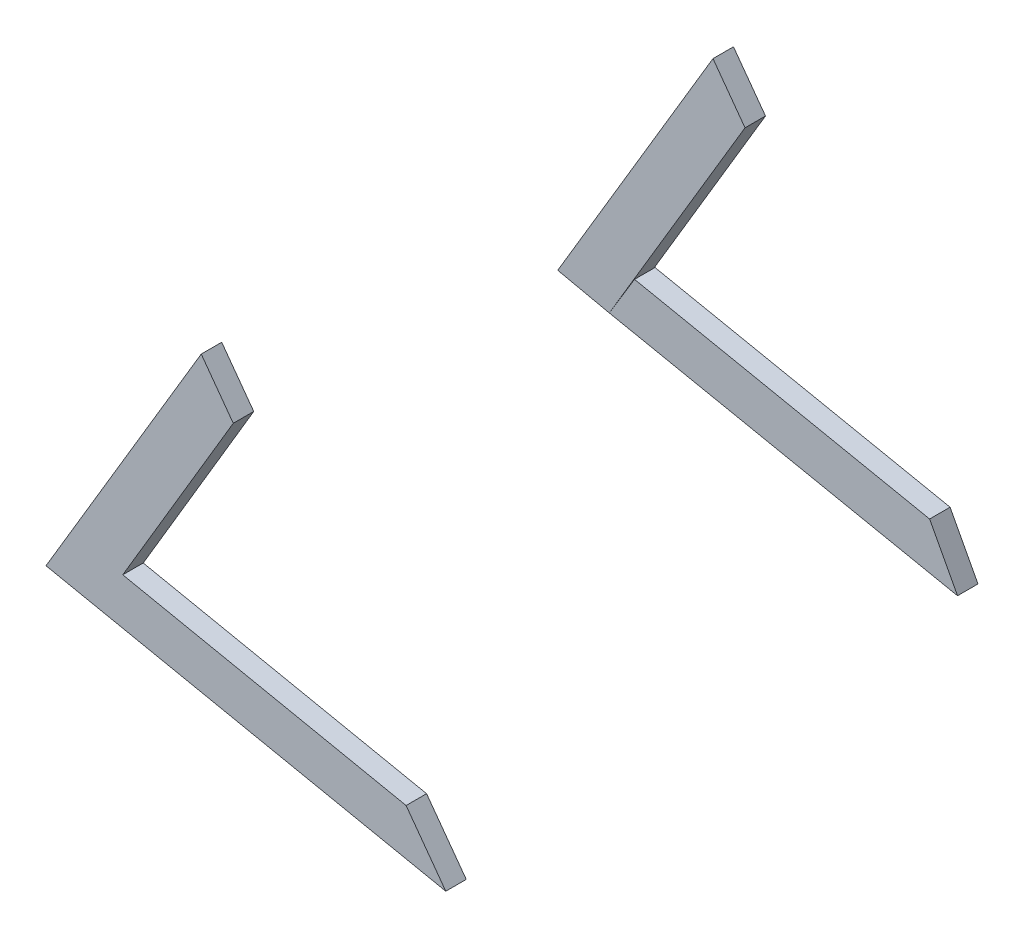
ISO-10303-21;
HEADER;
FILE_DESCRIPTION(('STEP AP214'),'2;1');
FILE_NAME('part.step','',(''),(''),'','','');
FILE_SCHEMA(('AUTOMOTIVE_DESIGN { 1 0 10303 214 1 1 1 1 }'));
ENDSEC;
DATA;
#1=APPLICATION_CONTEXT('core data for automotive mechanical design processes');
#2=APPLICATION_PROTOCOL_DEFINITION('international standard','automotive_design',2000,#1);
#3=PRODUCT_CONTEXT('',#1,'mechanical');
#4=PRODUCT('Part','Part','',(#3));
#5=PRODUCT_RELATED_PRODUCT_CATEGORY('part','',(#4));
#6=PRODUCT_DEFINITION_FORMATION('','',#4);
#7=PRODUCT_DEFINITION_CONTEXT('part definition',#1,'design');
#8=PRODUCT_DEFINITION('design','',#6,#7);
#9=PRODUCT_DEFINITION_SHAPE('','',#8);
#10=(LENGTH_UNIT() NAMED_UNIT(*) SI_UNIT(.MILLI.,.METRE.));
#11=(NAMED_UNIT(*) PLANE_ANGLE_UNIT() SI_UNIT($,.RADIAN.));
#12=(NAMED_UNIT(*) SI_UNIT($,.STERADIAN.) SOLID_ANGLE_UNIT());
#13=UNCERTAINTY_MEASURE_WITH_UNIT(LENGTH_MEASURE(1.E-05),#10,'distance_accuracy_value','');
#14=(GEOMETRIC_REPRESENTATION_CONTEXT(3) GLOBAL_UNCERTAINTY_ASSIGNED_CONTEXT((#13)) GLOBAL_UNIT_ASSIGNED_CONTEXT((#10,
#11,#12)) REPRESENTATION_CONTEXT('',''));
#15=CARTESIAN_POINT('',(0.,0.,0.));
#16=DIRECTION('',(0.,0.,1.));
#17=DIRECTION('',(1.,0.,0.));
#18=AXIS2_PLACEMENT_3D('',#15,#16,#17);
#19=CARTESIAN_POINT('',(-117.553090874824,16.4233246148434,228.608466666667));
#20=DIRECTION('',(0.860270610914541,-0.509837695739263,0.));
#21=DIRECTION('',(0.509837695739263,0.860270610914542,0.));
#22=AXIS2_PLACEMENT_3D('',#19,#20,#21);
#23=PLANE('',#22);
#24=DIRECTION('',(0.509837695739263,0.860270610914541,0.));
#25=VECTOR('',#24,1.);
#26=CARTESIAN_POINT('',(-117.553090874824,16.4233246148434,254.008466666667));
#27=LINE('',#26,#25);
#28=CARTESIAN_POINT('',(-117.553090874824,16.4233246148434,254.008466666667));
#29=VERTEX_POINT('',#28);
#30=CARTESIAN_POINT('',(19.5750936937245,247.805484267309,254.008466666667));
#31=VERTEX_POINT('',#30);
#32=EDGE_CURVE('E129',#29,#31,#27,.T.);
#33=ORIENTED_EDGE('',*,*,#32,.F.);
#34=DIRECTION('',(0.,0.,1.));
#35=VECTOR('',#34,1.);
#36=CARTESIAN_POINT('',(-117.553090874824,16.4233246148434,228.608466666667));
#37=LINE('',#36,#35);
#38=CARTESIAN_POINT('',(-117.553090874824,16.4233246148434,228.608466666667));
#39=VERTEX_POINT('',#38);
#40=EDGE_CURVE('E12',#39,#29,#37,.T.);
#41=ORIENTED_EDGE('',*,*,#40,.F.);
#42=DIRECTION('',(0.509837695739263,0.860270610914541,0.));
#43=VECTOR('',#42,1.);
#44=CARTESIAN_POINT('',(-117.553090874824,16.4233246148434,228.608466666667));
#45=LINE('',#44,#43);
#46=CARTESIAN_POINT('',(19.5750936937245,247.805484267309,228.608466666667));
#47=VERTEX_POINT('',#46);
#48=EDGE_CURVE('E143',#39,#47,#45,.T.);
#49=ORIENTED_EDGE('',*,*,#48,.T.);
#50=DIRECTION('',(0.,0.,1.));
#51=VECTOR('',#50,1.);
#52=CARTESIAN_POINT('',(19.5750936937245,247.805484267309,228.608466666667));
#53=LINE('',#52,#51);
#54=EDGE_CURVE('E47',#47,#31,#53,.T.);
#55=ORIENTED_EDGE('',*,*,#54,.T.);
#56=EDGE_LOOP('',(#33,#41,#49,#55));
#57=FACE_BOUND('',#56,.T.);
#58=ADVANCED_FACE('F44',(#57),#23,.T.);
#59=CARTESIAN_POINT('',(234.040197192423,-55.6809077185819,228.608466666667));
#60=DIRECTION('',(0.200897439783203,0.979612279776318,0.));
#61=DIRECTION('',(-0.979612279776318,0.200897439783203,0.));
#62=AXIS2_PLACEMENT_3D('',#59,#60,#61);
#63=PLANE('',#62);
#64=DIRECTION('',(-0.979612279776318,0.200897439783203,0.));
#65=VECTOR('',#64,1.);
#66=CARTESIAN_POINT('',(234.040197192423,-55.6809077185819,254.008466666667));
#67=LINE('',#66,#65);
#68=CARTESIAN_POINT('',(234.040197192423,-55.6809077185819,254.008466666667));
#69=VERTEX_POINT('',#68);
#70=EDGE_CURVE('E141',#69,#29,#67,.T.);
#71=ORIENTED_EDGE('',*,*,#70,.F.);
#72=DIRECTION('',(0.,0.,1.));
#73=VECTOR('',#72,1.);
#74=CARTESIAN_POINT('',(234.040197192423,-55.6809077185819,228.608466666667));
#75=LINE('',#74,#73);
#76=CARTESIAN_POINT('',(234.040197192423,-55.6809077185819,228.608466666667));
#77=VERTEX_POINT('',#76);
#78=EDGE_CURVE('E53',#77,#69,#75,.T.);
#79=ORIENTED_EDGE('',*,*,#78,.F.);
#80=DIRECTION('',(-0.979612279776318,0.200897439783203,0.));
#81=VECTOR('',#80,1.);
#82=CARTESIAN_POINT('',(234.040197192423,-55.6809077185819,228.608466666667));
#83=LINE('',#82,#81);
#84=EDGE_CURVE('E119',#77,#39,#83,.T.);
#85=ORIENTED_EDGE('',*,*,#84,.T.);
#86=ORIENTED_EDGE('',*,*,#40,.T.);
#87=EDGE_LOOP('',(#71,#79,#85,#86));
#88=FACE_BOUND('',#87,.T.);
#89=ADVANCED_FACE('F151',(#88),#63,.T.);
#90=CARTESIAN_POINT('',(283.257557222642,-123.191110578434,228.608466666667));
#91=DIRECTION('',(0.808057839026698,0.589103156321117,0.));
#92=DIRECTION('',(-0.589103156321117,0.808057839026698,0.));
#93=AXIS2_PLACEMENT_3D('',#90,#91,#92);
#94=PLANE('',#93);
#95=DIRECTION('',(-0.589103156321117,0.808057839026698,0.));
#96=VECTOR('',#95,1.);
#97=CARTESIAN_POINT('',(283.257557222642,-123.191110578434,254.008466666667));
#98=LINE('',#97,#96);
#99=CARTESIAN_POINT('',(283.257557222642,-123.191110578434,254.008466666667));
#100=VERTEX_POINT('',#99);
#101=EDGE_CURVE('E106',#100,#69,#98,.T.);
#102=ORIENTED_EDGE('',*,*,#101,.F.);
#103=DIRECTION('',(0.,0.,1.));
#104=VECTOR('',#103,1.);
#105=CARTESIAN_POINT('',(283.257557222642,-123.191110578434,228.608466666667));
#106=LINE('',#105,#104);
#107=CARTESIAN_POINT('',(283.257557222642,-123.191110578434,228.608466666667));
#108=VERTEX_POINT('',#107);
#109=EDGE_CURVE('E101',#108,#100,#106,.T.);
#110=ORIENTED_EDGE('',*,*,#109,.F.);
#111=DIRECTION('',(-0.589103156321117,0.808057839026698,0.));
#112=VECTOR('',#111,1.);
#113=CARTESIAN_POINT('',(283.257557222642,-123.191110578434,228.608466666667));
#114=LINE('',#113,#112);
#115=EDGE_CURVE('E104',#108,#77,#114,.T.);
#116=ORIENTED_EDGE('',*,*,#115,.T.);
#117=ORIENTED_EDGE('',*,*,#78,.T.);
#118=EDGE_LOOP('',(#102,#110,#116,#117));
#119=FACE_BOUND('',#118,.T.);
#120=ADVANCED_FACE('F103',(#119),#94,.T.);
#121=CARTESIAN_POINT('',(-212.796519633417,-21.4610729995281,228.608466666666));
#122=DIRECTION('',(-0.200897439783204,-0.979612279776317,0.));
#123=DIRECTION('',(0.979612279776317,-0.200897439783204,0.));
#124=AXIS2_PLACEMENT_3D('',#121,#122,#123);
#125=PLANE('',#124);
#126=DIRECTION('',(0.979612279776317,-0.200897439783204,0.));
#127=VECTOR('',#126,1.);
#128=CARTESIAN_POINT('',(-212.796519633417,-21.4610729995282,254.008466666666));
#129=LINE('',#128,#127);
#130=CARTESIAN_POINT('',(-212.796519633417,-21.4610729995282,254.008466666666));
#131=VERTEX_POINT('',#130);
#132=EDGE_CURVE('E138',#131,#100,#129,.T.);
#133=ORIENTED_EDGE('',*,*,#132,.F.);
#134=DIRECTION('',(0.,0.,1.));
#135=VECTOR('',#134,1.);
#136=CARTESIAN_POINT('',(-212.796519633417,-21.4610729995281,228.608466666666));
#137=LINE('',#136,#135);
#138=CARTESIAN_POINT('',(-212.796519633417,-21.4610729995281,228.608466666666));
#139=VERTEX_POINT('',#138);
#140=EDGE_CURVE('E111',#139,#131,#137,.T.);
#141=ORIENTED_EDGE('',*,*,#140,.F.);
#142=DIRECTION('',(0.979612279776317,-0.200897439783204,0.));
#143=VECTOR('',#142,1.);
#144=CARTESIAN_POINT('',(-212.796519633417,-21.4610729995281,228.608466666666));
#145=LINE('',#144,#143);
#146=EDGE_CURVE('E117',#139,#108,#145,.T.);
#147=ORIENTED_EDGE('',*,*,#146,.T.);
#148=ORIENTED_EDGE('',*,*,#109,.T.);
#149=EDGE_LOOP('',(#133,#141,#147,#148));
#150=FACE_BOUND('',#149,.T.);
#151=ADVANCED_FACE('F121',(#150),#125,.T.);
#152=CARTESIAN_POINT('',(-20.1707781777962,302.323887351923,228.608466666667));
#153=DIRECTION('',(-0.859413487907199,0.511281191521048,0.));
#154=DIRECTION('',(-0.511281191521048,-0.859413487907199,0.));
#155=AXIS2_PLACEMENT_3D('',#152,#153,#154);
#156=PLANE('',#155);
#157=DIRECTION('',(-0.511281191521048,-0.859413487907199,0.));
#158=VECTOR('',#157,1.);
#159=CARTESIAN_POINT('',(-20.1707781777962,302.323887351923,254.008466666667));
#160=LINE('',#159,#158);
#161=CARTESIAN_POINT('',(-20.1707781777962,302.323887351923,254.008466666667));
#162=VERTEX_POINT('',#161);
#163=EDGE_CURVE('E135',#162,#131,#160,.T.);
#164=ORIENTED_EDGE('',*,*,#163,.F.);
#165=DIRECTION('',(0.,0.,1.));
#166=VECTOR('',#165,1.);
#167=CARTESIAN_POINT('',(-20.1707781777962,302.323887351923,228.608466666667));
#168=LINE('',#167,#166);
#169=CARTESIAN_POINT('',(-20.1707781777962,302.323887351923,228.608466666667));
#170=VERTEX_POINT('',#169);
#171=EDGE_CURVE('E146',#170,#162,#168,.T.);
#172=ORIENTED_EDGE('',*,*,#171,.F.);
#173=DIRECTION('',(-0.511281191521048,-0.859413487907199,0.));
#174=VECTOR('',#173,1.);
#175=CARTESIAN_POINT('',(-20.1707781777962,302.323887351923,228.608466666667));
#176=LINE('',#175,#174);
#177=EDGE_CURVE('E122',#170,#139,#176,.T.);
#178=ORIENTED_EDGE('',*,*,#177,.T.);
#179=ORIENTED_EDGE('',*,*,#140,.T.);
#180=EDGE_LOOP('',(#164,#172,#178,#179));
#181=FACE_BOUND('',#180,.T.);
#182=ADVANCED_FACE('F164',(#181),#156,.T.);
#183=CARTESIAN_POINT('',(19.5750936937245,247.805484267309,228.608466666667));
#184=DIRECTION('',(0.808057839026698,0.589103156321117,0.));
#185=DIRECTION('',(-0.589103156321117,0.808057839026699,0.));
#186=AXIS2_PLACEMENT_3D('',#183,#184,#185);
#187=PLANE('',#186);
#188=DIRECTION('',(-0.589103156321117,0.808057839026698,0.));
#189=VECTOR('',#188,1.);
#190=CARTESIAN_POINT('',(19.5750936937245,247.805484267309,254.008466666667));
#191=LINE('',#190,#189);
#192=EDGE_CURVE('E132',#31,#162,#191,.T.);
#193=ORIENTED_EDGE('',*,*,#192,.F.);
#194=ORIENTED_EDGE('',*,*,#54,.F.);
#195=DIRECTION('',(-0.589103156321117,0.808057839026698,0.));
#196=VECTOR('',#195,1.);
#197=CARTESIAN_POINT('',(19.5750936937245,247.805484267309,228.608466666667));
#198=LINE('',#197,#196);
#199=EDGE_CURVE('E124',#47,#170,#198,.T.);
#200=ORIENTED_EDGE('',*,*,#199,.T.);
#201=ORIENTED_EDGE('',*,*,#171,.T.);
#202=EDGE_LOOP('',(#193,#194,#200,#201));
#203=FACE_BOUND('',#202,.T.);
#204=ADVANCED_FACE('F148',(#203),#187,.T.);
#205=CARTESIAN_POINT('',(-2.42270502828796E-13,-1.85914991608062E-13,228.608466666667));
#206=DIRECTION('',(0.,0.,-1.));
#207=DIRECTION('',(-1.,0.,0.));
#208=AXIS2_PLACEMENT_3D('',#205,#206,#207);
#209=PLANE('',#208);
#210=ORIENTED_EDGE('',*,*,#48,.F.);
#211=ORIENTED_EDGE('',*,*,#84,.F.);
#212=ORIENTED_EDGE('',*,*,#115,.F.);
#213=ORIENTED_EDGE('',*,*,#146,.F.);
#214=ORIENTED_EDGE('',*,*,#177,.F.);
#215=ORIENTED_EDGE('',*,*,#199,.F.);
#216=EDGE_LOOP('',(#210,#211,#212,#213,#214,#215));
#217=FACE_BOUND('',#216,.T.);
#218=ADVANCED_FACE('F115',(#217),#209,.T.);
#219=CARTESIAN_POINT('',(-2.69614855092981E-13,-2.05850005475127E-13,254.008466666667));
#220=DIRECTION('',(0.,0.,-1.));
#221=DIRECTION('',(-1.,0.,0.));
#222=AXIS2_PLACEMENT_3D('',#219,#220,#221);
#223=PLANE('',#222);
#224=ORIENTED_EDGE('',*,*,#32,.T.);
#225=ORIENTED_EDGE('',*,*,#192,.T.);
#226=ORIENTED_EDGE('',*,*,#163,.T.);
#227=ORIENTED_EDGE('',*,*,#132,.T.);
#228=ORIENTED_EDGE('',*,*,#101,.T.);
#229=ORIENTED_EDGE('',*,*,#70,.T.);
#230=EDGE_LOOP('',(#224,#225,#226,#227,#228,#229));
#231=FACE_BOUND('',#230,.T.);
#232=ADVANCED_FACE('F150',(#231),#223,.F.);
#233=CLOSED_SHELL('',(#58,#89,#120,#151,#182,#204,#218,#232));
#234=MANIFOLD_SOLID_BREP('B2',#233);
#235=CARTESIAN_POINT('',(19.5750936937253,247.805484267309,-380.991533333329));
#236=DIRECTION('',(0.808057839026695,0.589103156321121,0.));
#237=DIRECTION('',(-0.589103156321122,0.808057839026695,0.));
#238=AXIS2_PLACEMENT_3D('',#235,#236,#237);
#239=PLANE('',#238);
#240=DIRECTION('',(0.589103156321121,-0.808057839026695,0.));
#241=VECTOR('',#240,1.);
#242=CARTESIAN_POINT('',(19.5750936937253,247.805484267309,-406.391533333329));
#243=LINE('',#242,#241);
#244=CARTESIAN_POINT('',(-20.1707781777958,302.323887351923,-406.391533333329));
#245=VERTEX_POINT('',#244);
#246=CARTESIAN_POINT('',(19.5750936937253,247.805484267309,-406.391533333329));
#247=VERTEX_POINT('',#246);
#248=EDGE_CURVE('E293',#245,#247,#243,.T.);
#249=ORIENTED_EDGE('',*,*,#248,.F.);
#250=DIRECTION('',(0.,0.,-1.));
#251=VECTOR('',#250,1.);
#252=CARTESIAN_POINT('',(-20.1707781777958,302.323887351923,-380.991533333329));
#253=LINE('',#252,#251);
#254=CARTESIAN_POINT('',(-20.1707781777958,302.323887351923,-380.991533333329));
#255=VERTEX_POINT('',#254);
#256=EDGE_CURVE('E42',#255,#245,#253,.T.);
#257=ORIENTED_EDGE('',*,*,#256,.F.);
#258=DIRECTION('',(0.589103156321121,-0.808057839026695,0.));
#259=VECTOR('',#258,1.);
#260=CARTESIAN_POINT('',(19.5750936937253,247.805484267309,-380.991533333329));
#261=LINE('',#260,#259);
#262=CARTESIAN_POINT('',(19.5750936937253,247.805484267309,-380.991533333329));
#263=VERTEX_POINT('',#262);
#264=EDGE_CURVE('E287',#255,#263,#261,.T.);
#265=ORIENTED_EDGE('',*,*,#264,.T.);
#266=DIRECTION('',(0.,0.,-1.));
#267=VECTOR('',#266,1.);
#268=CARTESIAN_POINT('',(19.5750936937253,247.805484267309,-380.991533333329));
#269=LINE('',#268,#267);
#270=EDGE_CURVE('E232',#263,#247,#269,.T.);
#271=ORIENTED_EDGE('',*,*,#270,.T.);
#272=EDGE_LOOP('',(#249,#257,#265,#271));
#273=FACE_BOUND('',#272,.T.);
#274=ADVANCED_FACE('F229',(#273),#239,.T.);
#275=CARTESIAN_POINT('',(-20.1707781777958,302.323887351923,-380.991533333329));
#276=DIRECTION('',(-0.859413487907199,0.511281191521048,0.));
#277=DIRECTION('',(-0.511281191521048,-0.859413487907199,0.));
#278=AXIS2_PLACEMENT_3D('',#275,#276,#277);
#279=PLANE('',#278);
#280=DIRECTION('',(0.511281191521048,0.859413487907199,0.));
#281=VECTOR('',#280,1.);
#282=CARTESIAN_POINT('',(-20.1707781777958,302.323887351923,-406.391533333329));
#283=LINE('',#282,#281);
#284=CARTESIAN_POINT('',(-212.796519633416,-21.4610729995277,-406.391533333329));
#285=VERTEX_POINT('',#284);
#286=EDGE_CURVE('E289',#285,#245,#283,.T.);
#287=ORIENTED_EDGE('',*,*,#286,.F.);
#288=DIRECTION('',(0.,0.,-1.));
#289=VECTOR('',#288,1.);
#290=CARTESIAN_POINT('',(-212.796519633416,-21.4610729995277,-380.991533333329));
#291=LINE('',#290,#289);
#292=CARTESIAN_POINT('',(-212.796519633416,-21.4610729995277,-380.991533333329));
#293=VERTEX_POINT('',#292);
#294=EDGE_CURVE('E238',#293,#285,#291,.T.);
#295=ORIENTED_EDGE('',*,*,#294,.F.);
#296=DIRECTION('',(0.511281191521048,0.859413487907199,0.));
#297=VECTOR('',#296,1.);
#298=CARTESIAN_POINT('',(-20.1707781777958,302.323887351923,-380.991533333329));
#299=LINE('',#298,#297);
#300=EDGE_CURVE('E284',#293,#255,#299,.T.);
#301=ORIENTED_EDGE('',*,*,#300,.T.);
#302=ORIENTED_EDGE('',*,*,#256,.T.);
#303=EDGE_LOOP('',(#287,#295,#301,#302));
#304=FACE_BOUND('',#303,.T.);
#305=ADVANCED_FACE('F303',(#304),#279,.T.);
#306=CARTESIAN_POINT('',(-212.796519633416,-21.4610729995277,-380.991533333329));
#307=DIRECTION('',(-0.212068694836528,-0.97725476139558,0.));
#308=DIRECTION('',(0.97725476139558,-0.212068694836528,0.));
#309=AXIS2_PLACEMENT_3D('',#306,#307,#308);
#310=PLANE('',#309);
#311=DIRECTION('',(-0.97725476139558,0.212068694836528,0.));
#312=VECTOR('',#311,1.);
#313=CARTESIAN_POINT('',(-212.796519633416,-21.4610729995277,-406.391533333329));
#314=LINE('',#313,#312);
#315=CARTESIAN_POINT('',(-148.869597035476,-35.333503788098,-406.391533333329));
#316=VERTEX_POINT('',#315);
#317=EDGE_CURVE('E279',#316,#285,#314,.T.);
#318=ORIENTED_EDGE('',*,*,#317,.F.);
#319=DIRECTION('',(0.,0.,-1.));
#320=VECTOR('',#319,1.);
#321=CARTESIAN_POINT('',(-148.869597035476,-35.333503788098,-380.991533333329));
#322=LINE('',#321,#320);
#323=CARTESIAN_POINT('',(-148.869597035476,-35.333503788098,-380.991533333329));
#324=VERTEX_POINT('',#323);
#325=EDGE_CURVE('E274',#324,#316,#322,.T.);
#326=ORIENTED_EDGE('',*,*,#325,.F.);
#327=DIRECTION('',(-0.97725476139558,0.212068694836528,0.));
#328=VECTOR('',#327,1.);
#329=CARTESIAN_POINT('',(-212.796519633416,-21.4610729995277,-380.991533333329));
#330=LINE('',#329,#328);
#331=EDGE_CURVE('E277',#324,#293,#330,.T.);
#332=ORIENTED_EDGE('',*,*,#331,.T.);
#333=ORIENTED_EDGE('',*,*,#294,.T.);
#334=EDGE_LOOP('',(#318,#326,#332,#333));
#335=FACE_BOUND('',#334,.T.);
#336=ADVANCED_FACE('F276',(#335),#310,.T.);
#337=CARTESIAN_POINT('',(-148.869597035476,-35.333503788098,-380.991533333329));
#338=DIRECTION('',(0.859413487907199,-0.511281191521048,0.));
#339=DIRECTION('',(0.511281191521048,0.8594134879072,0.));
#340=AXIS2_PLACEMENT_3D('',#337,#338,#339);
#341=PLANE('',#340);
#342=DIRECTION('',(-0.511281191521048,-0.859413487907199,0.));
#343=VECTOR('',#342,1.);
#344=CARTESIAN_POINT('',(-148.869597035476,-35.333503788098,-406.391533333329));
#345=LINE('',#344,#343);
#346=EDGE_CURVE('E296',#247,#316,#345,.T.);
#347=ORIENTED_EDGE('',*,*,#346,.F.);
#348=ORIENTED_EDGE('',*,*,#270,.F.);
#349=DIRECTION('',(-0.511281191521048,-0.859413487907199,0.));
#350=VECTOR('',#349,1.);
#351=CARTESIAN_POINT('',(-148.869597035476,-35.333503788098,-380.991533333329));
#352=LINE('',#351,#350);
#353=EDGE_CURVE('E283',#263,#324,#352,.T.);
#354=ORIENTED_EDGE('',*,*,#353,.T.);
#355=ORIENTED_EDGE('',*,*,#325,.T.);
#356=EDGE_LOOP('',(#347,#348,#354,#355));
#357=FACE_BOUND('',#356,.T.);
#358=ADVANCED_FACE('F286',(#357),#341,.T.);
#359=CARTESIAN_POINT('',(4.46283924755751E-13,3.2535699301632E-13,-380.991533333329));
#360=DIRECTION('',(0.,0.,1.));
#361=DIRECTION('',(1.,0.,0.));
#362=AXIS2_PLACEMENT_3D('',#359,#360,#361);
#363=PLANE('',#362);
#364=ORIENTED_EDGE('',*,*,#264,.F.);
#365=ORIENTED_EDGE('',*,*,#300,.F.);
#366=ORIENTED_EDGE('',*,*,#331,.F.);
#367=ORIENTED_EDGE('',*,*,#353,.F.);
#368=EDGE_LOOP('',(#364,#365,#366,#367));
#369=FACE_BOUND('',#368,.T.);
#370=ADVANCED_FACE('F282',(#369),#363,.T.);
#371=CARTESIAN_POINT('',(4.73628277019936E-13,3.45292006883385E-13,-406.391533333329));
#372=DIRECTION('',(0.,0.,1.));
#373=DIRECTION('',(1.,0.,0.));
#374=AXIS2_PLACEMENT_3D('',#371,#372,#373);
#375=PLANE('',#374);
#376=ORIENTED_EDGE('',*,*,#248,.T.);
#377=ORIENTED_EDGE('',*,*,#346,.T.);
#378=ORIENTED_EDGE('',*,*,#317,.T.);
#379=ORIENTED_EDGE('',*,*,#286,.T.);
#380=EDGE_LOOP('',(#376,#377,#378,#379));
#381=FACE_BOUND('',#380,.T.);
#382=ADVANCED_FACE('F302',(#381),#375,.F.);
#383=CLOSED_SHELL('',(#274,#305,#336,#358,#370,#382));
#384=MANIFOLD_SOLID_BREP('B6',#383);
#385=CARTESIAN_POINT('',(283.257557222643,-123.191110578434,-380.991533333329));
#386=DIRECTION('',(-0.199238024868072,-0.979951126050003,0.));
#387=DIRECTION('',(0.979951126050003,-0.199238024868072,0.));
#388=AXIS2_PLACEMENT_3D('',#385,#386,#387);
#389=PLANE('',#388);
#390=DIRECTION('',(-0.979951126050003,0.199238024868072,0.));
#391=VECTOR('',#390,1.);
#392=CARTESIAN_POINT('',(283.257557222643,-123.191110578434,-406.391533333329));
#393=LINE('',#392,#391);
#394=CARTESIAN_POINT('',(283.257557222643,-123.191110578434,-406.391533333329));
#395=VERTEX_POINT('',#394);
#396=CARTESIAN_POINT('',(-148.869597035476,-35.3335037880979,-406.391533333329));
#397=VERTEX_POINT('',#396);
#398=EDGE_CURVE('E417',#395,#397,#393,.T.);
#399=ORIENTED_EDGE('',*,*,#398,.F.);
#400=DIRECTION('',(0.,0.,-1.));
#401=VECTOR('',#400,1.);
#402=CARTESIAN_POINT('',(283.257557222643,-123.191110578434,-380.991533333329));
#403=LINE('',#402,#401);
#404=CARTESIAN_POINT('',(283.257557222643,-123.191110578434,-380.991533333329));
#405=VERTEX_POINT('',#404);
#406=EDGE_CURVE('E227',#405,#395,#403,.T.);
#407=ORIENTED_EDGE('',*,*,#406,.F.);
#408=DIRECTION('',(-0.979951126050003,0.199238024868072,0.));
#409=VECTOR('',#408,1.);
#410=CARTESIAN_POINT('',(283.257557222643,-123.191110578434,-380.991533333329));
#411=LINE('',#410,#409);
#412=CARTESIAN_POINT('',(-148.869597035476,-35.3335037880979,-380.991533333329));
#413=VERTEX_POINT('',#412);
#414=EDGE_CURVE('E411',#405,#413,#411,.T.);
#415=ORIENTED_EDGE('',*,*,#414,.T.);
#416=DIRECTION('',(0.,0.,-1.));
#417=VECTOR('',#416,1.);
#418=CARTESIAN_POINT('',(-148.869597035476,-35.3335037880979,-380.991533333329));
#419=LINE('',#418,#417);
#420=EDGE_CURVE('E356',#413,#397,#419,.T.);
#421=ORIENTED_EDGE('',*,*,#420,.T.);
#422=EDGE_LOOP('',(#399,#407,#415,#421));
#423=FACE_BOUND('',#422,.T.);
#424=ADVANCED_FACE('F353',(#423),#389,.T.);
#425=CARTESIAN_POINT('',(248.617806819178,-58.024435565595,-380.991533333329));
#426=DIRECTION('',(0.883003671158202,0.469366079644809,0.));
#427=DIRECTION('',(-0.469366079644809,0.883003671158202,0.));
#428=AXIS2_PLACEMENT_3D('',#425,#426,#427);
#429=PLANE('',#428);
#430=DIRECTION('',(0.469366079644809,-0.883003671158202,0.));
#431=VECTOR('',#430,1.);
#432=CARTESIAN_POINT('',(248.617806819178,-58.024435565595,-406.391533333329));
#433=LINE('',#432,#431);
#434=CARTESIAN_POINT('',(248.617806819178,-58.024435565595,-406.391533333329));
#435=VERTEX_POINT('',#434);
#436=EDGE_CURVE('E413',#435,#395,#433,.T.);
#437=ORIENTED_EDGE('',*,*,#436,.F.);
#438=DIRECTION('',(0.,0.,-1.));
#439=VECTOR('',#438,1.);
#440=CARTESIAN_POINT('',(248.617806819178,-58.024435565595,-380.991533333329));
#441=LINE('',#440,#439);
#442=CARTESIAN_POINT('',(248.617806819178,-58.024435565595,-380.991533333329));
#443=VERTEX_POINT('',#442);
#444=EDGE_CURVE('E362',#443,#435,#441,.T.);
#445=ORIENTED_EDGE('',*,*,#444,.F.);
#446=DIRECTION('',(0.469366079644809,-0.883003671158202,0.));
#447=VECTOR('',#446,1.);
#448=CARTESIAN_POINT('',(248.617806819178,-58.024435565595,-380.991533333329));
#449=LINE('',#448,#447);
#450=EDGE_CURVE('E408',#443,#405,#449,.T.);
#451=ORIENTED_EDGE('',*,*,#450,.T.);
#452=ORIENTED_EDGE('',*,*,#406,.T.);
#453=EDGE_LOOP('',(#437,#445,#451,#452));
#454=FACE_BOUND('',#453,.T.);
#455=ADVANCED_FACE('F427',(#454),#429,.T.);
#456=CARTESIAN_POINT('',(-117.553090874824,16.4233246148438,-380.991533333329));
#457=DIRECTION('',(0.199238024868072,0.979951126050003,0.));
#458=DIRECTION('',(-0.979951126050004,0.199238024868072,0.));
#459=AXIS2_PLACEMENT_3D('',#456,#457,#458);
#460=PLANE('',#459);
#461=DIRECTION('',(0.979951126050003,-0.199238024868072,0.));
#462=VECTOR('',#461,1.);
#463=CARTESIAN_POINT('',(-117.553090874824,16.4233246148439,-406.391533333329));
#464=LINE('',#463,#462);
#465=CARTESIAN_POINT('',(-117.553090874824,16.4233246148439,-406.391533333329));
#466=VERTEX_POINT('',#465);
#467=EDGE_CURVE('E403',#466,#435,#464,.T.);
#468=ORIENTED_EDGE('',*,*,#467,.F.);
#469=DIRECTION('',(0.,0.,-1.));
#470=VECTOR('',#469,1.);
#471=CARTESIAN_POINT('',(-117.553090874824,16.4233246148438,-380.991533333329));
#472=LINE('',#471,#470);
#473=CARTESIAN_POINT('',(-117.553090874824,16.4233246148438,-380.991533333329));
#474=VERTEX_POINT('',#473);
#475=EDGE_CURVE('E398',#474,#466,#472,.T.);
#476=ORIENTED_EDGE('',*,*,#475,.F.);
#477=DIRECTION('',(0.979951126050003,-0.199238024868072,0.));
#478=VECTOR('',#477,1.);
#479=CARTESIAN_POINT('',(-117.553090874824,16.4233246148438,-380.991533333329));
#480=LINE('',#479,#478);
#481=EDGE_CURVE('E401',#474,#443,#480,.T.);
#482=ORIENTED_EDGE('',*,*,#481,.T.);
#483=ORIENTED_EDGE('',*,*,#444,.T.);
#484=EDGE_LOOP('',(#468,#476,#482,#483));
#485=FACE_BOUND('',#484,.T.);
#486=ADVANCED_FACE('F400',(#485),#460,.T.);
#487=CARTESIAN_POINT('',(-148.869597035476,-35.3335037880979,-380.991533333329));
#488=DIRECTION('',(-0.855573263071097,0.517681747329259,0.));
#489=DIRECTION('',(-0.517681747329259,-0.855573263071097,0.));
#490=AXIS2_PLACEMENT_3D('',#487,#488,#489);
#491=PLANE('',#490);
#492=DIRECTION('',(0.517681747329259,0.855573263071097,0.));
#493=VECTOR('',#492,1.);
#494=CARTESIAN_POINT('',(-148.869597035476,-35.3335037880979,-406.391533333329));
#495=LINE('',#494,#493);
#496=EDGE_CURVE('E420',#397,#466,#495,.T.);
#497=ORIENTED_EDGE('',*,*,#496,.F.);
#498=ORIENTED_EDGE('',*,*,#420,.F.);
#499=DIRECTION('',(0.517681747329259,0.855573263071097,0.));
#500=VECTOR('',#499,1.);
#501=CARTESIAN_POINT('',(-148.869597035476,-35.3335037880979,-380.991533333329));
#502=LINE('',#501,#500);
#503=EDGE_CURVE('E407',#413,#474,#502,.T.);
#504=ORIENTED_EDGE('',*,*,#503,.T.);
#505=ORIENTED_EDGE('',*,*,#475,.T.);
#506=EDGE_LOOP('',(#497,#498,#504,#505));
#507=FACE_BOUND('',#506,.T.);
#508=ADVANCED_FACE('F410',(#507),#491,.T.);
#509=CARTESIAN_POINT('',(5.02369084939031E-13,5.31291761279806E-13,-380.991533333329));
#510=DIRECTION('',(0.,0.,-1.));
#511=DIRECTION('',(0.,1.,0.));
#512=AXIS2_PLACEMENT_3D('',#509,#510,#511);
#513=PLANE('',#512);
#514=ORIENTED_EDGE('',*,*,#414,.F.);
#515=ORIENTED_EDGE('',*,*,#450,.F.);
#516=ORIENTED_EDGE('',*,*,#481,.F.);
#517=ORIENTED_EDGE('',*,*,#503,.F.);
#518=EDGE_LOOP('',(#514,#515,#516,#517));
#519=FACE_BOUND('',#518,.T.);
#520=ADVANCED_FACE('F406',(#519),#513,.F.);
#521=CARTESIAN_POINT('',(5.29713437203215E-13,5.51226775146871E-13,-406.391533333329));
#522=DIRECTION('',(0.,0.,-1.));
#523=DIRECTION('',(0.,1.,0.));
#524=AXIS2_PLACEMENT_3D('',#521,#522,#523);
#525=PLANE('',#524);
#526=ORIENTED_EDGE('',*,*,#398,.T.);
#527=ORIENTED_EDGE('',*,*,#496,.T.);
#528=ORIENTED_EDGE('',*,*,#467,.T.);
#529=ORIENTED_EDGE('',*,*,#436,.T.);
#530=EDGE_LOOP('',(#526,#527,#528,#529));
#531=FACE_BOUND('',#530,.T.);
#532=ADVANCED_FACE('F426',(#531),#525,.T.);
#533=CLOSED_SHELL('',(#424,#455,#486,#508,#520,#532));
#534=MANIFOLD_SOLID_BREP('B36',#533);
#535=ADVANCED_BREP_SHAPE_REPRESENTATION('',(#18,#234,#384,#534),#14);
#536=SHAPE_DEFINITION_REPRESENTATION(#9,#535);
ENDSEC;
END-ISO-10303-21;
